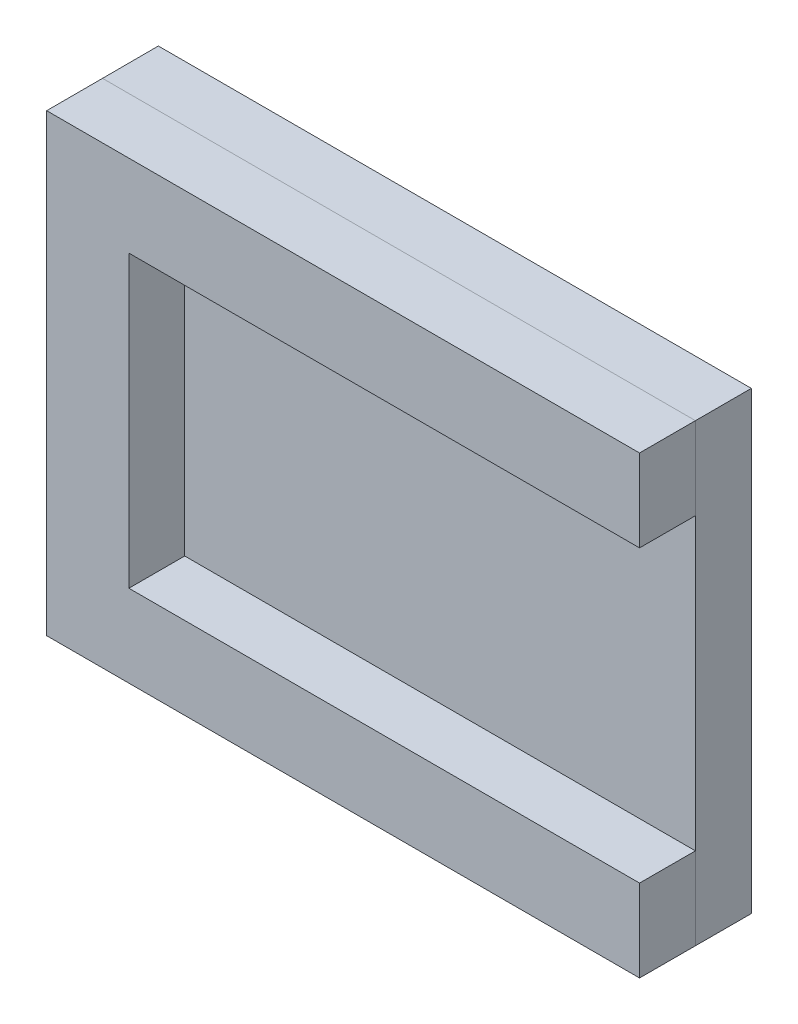
ISO-10303-21;
HEADER;
FILE_DESCRIPTION(('STEP AP214'),'2;1');
FILE_NAME('part.step','',(''),(''),'','','');
FILE_SCHEMA(('AUTOMOTIVE_DESIGN { 1 0 10303 214 1 1 1 1 }'));
ENDSEC;
DATA;
#1=APPLICATION_CONTEXT('core data for automotive mechanical design processes');
#2=APPLICATION_PROTOCOL_DEFINITION('international standard','automotive_design',2000,#1);
#3=PRODUCT_CONTEXT('',#1,'mechanical');
#4=PRODUCT('Part','Part','',(#3));
#5=PRODUCT_RELATED_PRODUCT_CATEGORY('part','',(#4));
#6=PRODUCT_DEFINITION_FORMATION('','',#4);
#7=PRODUCT_DEFINITION_CONTEXT('part definition',#1,'design');
#8=PRODUCT_DEFINITION('design','',#6,#7);
#9=PRODUCT_DEFINITION_SHAPE('','',#8);
#10=(LENGTH_UNIT() NAMED_UNIT(*) SI_UNIT(.MILLI.,.METRE.));
#11=(NAMED_UNIT(*) PLANE_ANGLE_UNIT() SI_UNIT($,.RADIAN.));
#12=(NAMED_UNIT(*) SI_UNIT($,.STERADIAN.) SOLID_ANGLE_UNIT());
#13=UNCERTAINTY_MEASURE_WITH_UNIT(LENGTH_MEASURE(1.E-05),#10,'distance_accuracy_value','');
#14=(GEOMETRIC_REPRESENTATION_CONTEXT(3) GLOBAL_UNCERTAINTY_ASSIGNED_CONTEXT((#13)) GLOBAL_UNIT_ASSIGNED_CONTEXT((#10,
#11,#12)) REPRESENTATION_CONTEXT('',''));
#15=CARTESIAN_POINT('',(0.,0.,0.));
#16=DIRECTION('',(0.,0.,1.));
#17=DIRECTION('',(1.,0.,0.));
#18=AXIS2_PLACEMENT_3D('',#15,#16,#17);
#19=CARTESIAN_POINT('',(-41.7587994731434,0.,3.));
#20=DIRECTION('',(1.,0.,0.));
#21=DIRECTION('',(0.,0.,-1.));
#22=AXIS2_PLACEMENT_3D('',#19,#20,#21);
#23=PLANE('',#22);
#24=CARTESIAN_POINT('',(-41.7527595629394,-30.6599415069898,0.));
#25=DIRECTION('',(0.,-1.,0.));
#26=VECTOR('',#25,1.);
#27=LINE('',#24,#26);
#28=CARTESIAN_POINT('',(-41.7557795180414,-30.6599415069898,0.));
#29=VERTEX_POINT('',#28);
#30=CARTESIAN_POINT('',(-41.7557795180414,-35.077278712933,0.));
#31=VERTEX_POINT('',#30);
#32=EDGE_CURVE('E157',#29,#31,#27,.T.);
#33=ORIENTED_EDGE('',*,*,#32,.F.);
#34=DIRECTION('',(0.,0.,-1.));
#35=VECTOR('',#34,1.);
#36=CARTESIAN_POINT('',(-41.7587994731434,-30.6599415069898,3.));
#37=LINE('',#36,#35);
#38=CARTESIAN_POINT('',(-41.7587994731434,-30.6599415069898,3.));
#39=VERTEX_POINT('',#38);
#40=EDGE_CURVE('E11',#39,#29,#37,.T.);
#41=ORIENTED_EDGE('',*,*,#40,.F.);
#42=DIRECTION('',(0.,-1.,0.));
#43=VECTOR('',#42,1.);
#44=CARTESIAN_POINT('',(-41.7587994731434,0.,3.));
#45=LINE('',#44,#43);
#46=CARTESIAN_POINT('',(-41.7587994731434,-35.077278712933,3.));
#47=VERTEX_POINT('',#46);
#48=EDGE_CURVE('E241',#39,#47,#45,.T.);
#49=ORIENTED_EDGE('',*,*,#48,.T.);
#50=DIRECTION('',(0.,0.,-1.));
#51=VECTOR('',#50,1.);
#52=CARTESIAN_POINT('',(-41.7587994731434,-35.077278712933,3.));
#53=LINE('',#52,#51);
#54=EDGE_CURVE('E93',#47,#31,#53,.T.);
#55=ORIENTED_EDGE('',*,*,#54,.T.);
#56=EDGE_LOOP('',(#33,#41,#49,#55));
#57=FACE_BOUND('',#56,.T.);
#58=ADVANCED_FACE('F41',(#57),#23,.T.);
#59=CARTESIAN_POINT('',(0.,-30.6599415069898,3.));
#60=DIRECTION('',(0.,1.,0.));
#61=DIRECTION('',(0.,0.,1.));
#62=AXIS2_PLACEMENT_3D('',#59,#60,#61);
#63=PLANE('',#62);
#64=DIRECTION('',(1.,0.,0.));
#65=VECTOR('',#64,1.);
#66=CARTESIAN_POINT('',(0.,-30.6599415069898,0.));
#67=LINE('',#66,#65);
#68=CARTESIAN_POINT('',(-69.1946390522348,-30.6599415069898,0.));
#69=VERTEX_POINT('',#68);
#70=EDGE_CURVE('E146',#69,#29,#67,.T.);
#71=ORIENTED_EDGE('',*,*,#70,.F.);
#72=DIRECTION('',(0.,0.,-1.));
#73=VECTOR('',#72,1.);
#74=CARTESIAN_POINT('',(-69.1946390522348,-30.6599415069898,3.));
#75=LINE('',#74,#73);
#76=CARTESIAN_POINT('',(-69.1946390522348,-30.6599415069898,3.));
#77=VERTEX_POINT('',#76);
#78=EDGE_CURVE('E52',#77,#69,#75,.T.);
#79=ORIENTED_EDGE('',*,*,#78,.F.);
#80=DIRECTION('',(1.,0.,0.));
#81=VECTOR('',#80,1.);
#82=CARTESIAN_POINT('',(0.,-30.6599415069898,3.));
#83=LINE('',#82,#81);
#84=EDGE_CURVE('E287',#77,#39,#83,.T.);
#85=ORIENTED_EDGE('',*,*,#84,.T.);
#86=ORIENTED_EDGE('',*,*,#40,.T.);
#87=EDGE_LOOP('',(#71,#79,#85,#86));
#88=FACE_BOUND('',#87,.T.);
#89=ADVANCED_FACE('F322',(#88),#63,.T.);
#90=CARTESIAN_POINT('',(-69.1946390522348,0.,3.));
#91=DIRECTION('',(1.,0.,0.));
#92=DIRECTION('',(0.,0.,-1.));
#93=AXIS2_PLACEMENT_3D('',#90,#91,#92);
#94=PLANE('',#93);
#95=DIRECTION('',(0.,-1.,0.));
#96=VECTOR('',#95,1.);
#97=CARTESIAN_POINT('',(-69.1946390522348,0.,0.));
#98=LINE('',#97,#96);
#99=CARTESIAN_POINT('',(-69.1946390522348,-15.065028643299,0.));
#100=VERTEX_POINT('',#99);
#101=EDGE_CURVE('E141',#100,#69,#98,.T.);
#102=ORIENTED_EDGE('',*,*,#101,.F.);
#103=DIRECTION('',(0.,0.,-1.));
#104=VECTOR('',#103,1.);
#105=CARTESIAN_POINT('',(-69.1946390522348,-15.065028643299,3.));
#106=LINE('',#105,#104);
#107=CARTESIAN_POINT('',(-69.1946390522348,-15.065028643299,3.));
#108=VERTEX_POINT('',#107);
#109=EDGE_CURVE('E149',#108,#100,#106,.T.);
#110=ORIENTED_EDGE('',*,*,#109,.F.);
#111=DIRECTION('',(0.,-1.,0.));
#112=VECTOR('',#111,1.);
#113=CARTESIAN_POINT('',(-69.1946390522348,0.,3.));
#114=LINE('',#113,#112);
#115=EDGE_CURVE('E291',#108,#77,#114,.T.);
#116=ORIENTED_EDGE('',*,*,#115,.T.);
#117=ORIENTED_EDGE('',*,*,#78,.T.);
#118=EDGE_LOOP('',(#102,#110,#116,#117));
#119=FACE_BOUND('',#118,.T.);
#120=ADVANCED_FACE('F326',(#119),#94,.T.);
#121=CARTESIAN_POINT('',(0.,-15.065028643299,3.));
#122=DIRECTION('',(0.,1.,0.));
#123=DIRECTION('',(0.,0.,1.));
#124=AXIS2_PLACEMENT_3D('',#121,#122,#123);
#125=PLANE('',#124);
#126=DIRECTION('',(1.,0.,0.));
#127=VECTOR('',#126,1.);
#128=CARTESIAN_POINT('',(0.,-15.065028643299,0.));
#129=LINE('',#128,#127);
#130=CARTESIAN_POINT('',(-41.7557795180414,-15.065028643299,0.));
#131=VERTEX_POINT('',#130);
#132=EDGE_CURVE('E145',#100,#131,#129,.T.);
#133=ORIENTED_EDGE('',*,*,#132,.T.);
#134=DIRECTION('',(0.,0.,-1.));
#135=VECTOR('',#134,1.);
#136=CARTESIAN_POINT('',(-41.7587994731434,-15.065028643299,3.));
#137=LINE('',#136,#135);
#138=CARTESIAN_POINT('',(-41.7587994731434,-15.065028643299,3.));
#139=VERTEX_POINT('',#138);
#140=EDGE_CURVE('E152',#139,#131,#137,.T.);
#141=ORIENTED_EDGE('',*,*,#140,.F.);
#142=DIRECTION('',(1.,0.,0.));
#143=VECTOR('',#142,1.);
#144=CARTESIAN_POINT('',(0.,-15.065028643299,3.));
#145=LINE('',#144,#143);
#146=EDGE_CURVE('E295',#108,#139,#145,.T.);
#147=ORIENTED_EDGE('',*,*,#146,.F.);
#148=ORIENTED_EDGE('',*,*,#109,.T.);
#149=EDGE_LOOP('',(#133,#141,#147,#148));
#150=FACE_BOUND('',#149,.T.);
#151=ADVANCED_FACE('F196',(#150),#125,.F.);
#152=CARTESIAN_POINT('',(-41.7587994731434,0.,3.));
#153=DIRECTION('',(-1.,0.,0.));
#154=DIRECTION('',(0.,0.,1.));
#155=AXIS2_PLACEMENT_3D('',#152,#153,#154);
#156=PLANE('',#155);
#157=CARTESIAN_POINT('',(-41.7587994731434,-15.065028643299,0.));
#158=DIRECTION('',(0.,1.,0.));
#159=VECTOR('',#158,1.);
#160=LINE('',#157,#159);
#161=CARTESIAN_POINT('',(-41.7557795180414,-10.6429825061691,0.));
#162=VERTEX_POINT('',#161);
#163=EDGE_CURVE('E212',#131,#162,#160,.T.);
#164=ORIENTED_EDGE('',*,*,#163,.T.);
#165=DIRECTION('',(0.,0.,-1.));
#166=VECTOR('',#165,1.);
#167=CARTESIAN_POINT('',(-41.7587994731434,-10.6476914373559,3.));
#168=LINE('',#167,#166);
#169=CARTESIAN_POINT('',(-41.7587994731434,-10.6476914373559,3.));
#170=VERTEX_POINT('',#169);
#171=EDGE_CURVE('E129',#170,#162,#168,.T.);
#172=ORIENTED_EDGE('',*,*,#171,.F.);
#173=DIRECTION('',(0.,1.,0.));
#174=VECTOR('',#173,1.);
#175=CARTESIAN_POINT('',(-41.7587994731434,0.,3.));
#176=LINE('',#175,#174);
#177=EDGE_CURVE('E119',#139,#170,#176,.T.);
#178=ORIENTED_EDGE('',*,*,#177,.F.);
#179=ORIENTED_EDGE('',*,*,#140,.T.);
#180=EDGE_LOOP('',(#164,#172,#178,#179));
#181=FACE_BOUND('',#180,.T.);
#182=ADVANCED_FACE('F191',(#181),#156,.F.);
#183=CARTESIAN_POINT('',(0.,-10.6476914373559,3.));
#184=DIRECTION('',(0.,-1.,0.));
#185=DIRECTION('',(0.,0.,-1.));
#186=AXIS2_PLACEMENT_3D('',#183,#184,#185);
#187=PLANE('',#186);
#188=CARTESIAN_POINT('',(-41.7587994731434,-10.6476914373559,0.));
#189=DIRECTION('',(-1.,0.,0.));
#190=VECTOR('',#189,1.);
#191=LINE('',#188,#190);
#192=CARTESIAN_POINT('',(-73.6119762581779,-10.6429825061691,0.));
#193=VERTEX_POINT('',#192);
#194=EDGE_CURVE('E85',#162,#193,#191,.T.);
#195=ORIENTED_EDGE('',*,*,#194,.T.);
#196=DIRECTION('',(0.,0.,-1.));
#197=VECTOR('',#196,1.);
#198=CARTESIAN_POINT('',(-73.6119762581779,-10.6476914373559,3.));
#199=LINE('',#198,#197);
#200=CARTESIAN_POINT('',(-73.6119762581779,-10.6476914373559,3.));
#201=VERTEX_POINT('',#200);
#202=EDGE_CURVE('E123',#201,#193,#199,.T.);
#203=ORIENTED_EDGE('',*,*,#202,.F.);
#204=DIRECTION('',(-1.,0.,0.));
#205=VECTOR('',#204,1.);
#206=CARTESIAN_POINT('',(0.,-10.6476914373559,3.));
#207=LINE('',#206,#205);
#208=EDGE_CURVE('E113',#170,#201,#207,.T.);
#209=ORIENTED_EDGE('',*,*,#208,.F.);
#210=ORIENTED_EDGE('',*,*,#171,.T.);
#211=EDGE_LOOP('',(#195,#203,#209,#210));
#212=FACE_BOUND('',#211,.T.);
#213=ADVANCED_FACE('F124',(#212),#187,.F.);
#214=CARTESIAN_POINT('',(-73.6119762581779,0.,3.));
#215=DIRECTION('',(1.,0.,0.));
#216=DIRECTION('',(0.,0.,-1.));
#217=AXIS2_PLACEMENT_3D('',#214,#215,#216);
#218=PLANE('',#217);
#219=ORIENTED_EDGE('',*,*,#202,.T.);
#220=DIRECTION('',(0.,0.,1.));
#221=VECTOR('',#220,1.);
#222=CARTESIAN_POINT('',(-73.6119762581779,-10.6382735749824,-3.));
#223=LINE('',#222,#221);
#224=CARTESIAN_POINT('',(-73.6119762581779,-10.6382735749824,-3.));
#225=VERTEX_POINT('',#224);
#226=EDGE_CURVE('E235',#225,#193,#223,.T.);
#227=ORIENTED_EDGE('',*,*,#226,.F.);
#228=DIRECTION('',(0.,1.,0.));
#229=VECTOR('',#228,1.);
#230=CARTESIAN_POINT('',(-73.6119762581779,-35.077278712933,-3.));
#231=LINE('',#230,#229);
#232=CARTESIAN_POINT('',(-73.6119762581779,-35.077278712933,-3.));
#233=VERTEX_POINT('',#232);
#234=EDGE_CURVE('E305',#233,#225,#231,.T.);
#235=ORIENTED_EDGE('',*,*,#234,.F.);
#236=DIRECTION('',(0.,0.,-1.));
#237=VECTOR('',#236,1.);
#238=CARTESIAN_POINT('',(-73.6119762581779,-35.077278712933,3.));
#239=LINE('',#238,#237);
#240=CARTESIAN_POINT('',(-73.6119762581779,-35.077278712933,3.));
#241=VERTEX_POINT('',#240);
#242=EDGE_CURVE('E130',#241,#233,#239,.T.);
#243=ORIENTED_EDGE('',*,*,#242,.F.);
#244=DIRECTION('',(0.,-1.,0.));
#245=VECTOR('',#244,1.);
#246=CARTESIAN_POINT('',(-73.6119762581779,0.,3.));
#247=LINE('',#246,#245);
#248=EDGE_CURVE('E116',#201,#241,#247,.T.);
#249=ORIENTED_EDGE('',*,*,#248,.F.);
#250=EDGE_LOOP('',(#219,#227,#235,#243,#249));
#251=FACE_BOUND('',#250,.T.);
#252=ADVANCED_FACE('F132',(#251),#218,.F.);
#253=CARTESIAN_POINT('',(0.,-35.077278712933,3.));
#254=DIRECTION('',(0.,1.,0.));
#255=DIRECTION('',(0.,0.,1.));
#256=AXIS2_PLACEMENT_3D('',#253,#254,#255);
#257=PLANE('',#256);
#258=ORIENTED_EDGE('',*,*,#242,.T.);
#259=DIRECTION('',(1.,0.,0.));
#260=VECTOR('',#259,1.);
#261=CARTESIAN_POINT('',(-73.6119762581779,-35.077278712933,-3.));
#262=LINE('',#261,#260);
#263=CARTESIAN_POINT('',(-41.7527595629394,-35.077278712933,-3.));
#264=VERTEX_POINT('',#263);
#265=EDGE_CURVE('E236',#233,#264,#262,.T.);
#266=ORIENTED_EDGE('',*,*,#265,.T.);
#267=DIRECTION('',(0.,0.,1.));
#268=VECTOR('',#267,1.);
#269=CARTESIAN_POINT('',(-41.7527595629394,-35.077278712933,-3.));
#270=LINE('',#269,#268);
#271=EDGE_CURVE('E272',#264,#31,#270,.T.);
#272=ORIENTED_EDGE('',*,*,#271,.T.);
#273=ORIENTED_EDGE('',*,*,#54,.F.);
#274=DIRECTION('',(1.,0.,0.));
#275=VECTOR('',#274,1.);
#276=CARTESIAN_POINT('',(0.,-35.077278712933,3.));
#277=LINE('',#276,#275);
#278=EDGE_CURVE('E61',#241,#47,#277,.T.);
#279=ORIENTED_EDGE('',*,*,#278,.F.);
#280=EDGE_LOOP('',(#258,#266,#272,#273,#279));
#281=FACE_BOUND('',#280,.T.);
#282=ADVANCED_FACE('F372',(#281),#257,.F.);
#283=CARTESIAN_POINT('',(0.,0.,3.));
#284=DIRECTION('',(0.,0.,1.));
#285=DIRECTION('',(1.,0.,0.));
#286=AXIS2_PLACEMENT_3D('',#283,#284,#285);
#287=PLANE('',#286);
#288=ORIENTED_EDGE('',*,*,#48,.F.);
#289=ORIENTED_EDGE('',*,*,#84,.F.);
#290=ORIENTED_EDGE('',*,*,#115,.F.);
#291=ORIENTED_EDGE('',*,*,#146,.T.);
#292=ORIENTED_EDGE('',*,*,#177,.T.);
#293=ORIENTED_EDGE('',*,*,#208,.T.);
#294=ORIENTED_EDGE('',*,*,#248,.T.);
#295=ORIENTED_EDGE('',*,*,#278,.T.);
#296=EDGE_LOOP('',(#288,#289,#290,#291,#292,#293,#294,#295));
#297=FACE_BOUND('',#296,.T.);
#298=ADVANCED_FACE('F114',(#297),#287,.T.);
#299=CARTESIAN_POINT('',(-41.7527595629394,-35.077278712933,-3.));
#300=DIRECTION('',(1.,0.,0.));
#301=DIRECTION('',(0.,0.,-1.));
#302=AXIS2_PLACEMENT_3D('',#299,#300,#301);
#303=PLANE('',#302);
#304=ORIENTED_EDGE('',*,*,#32,.T.);
#305=ORIENTED_EDGE('',*,*,#271,.F.);
#306=DIRECTION('',(0.,1.,0.));
#307=VECTOR('',#306,1.);
#308=CARTESIAN_POINT('',(-41.7527595629394,-35.077278712933,-3.));
#309=LINE('',#308,#307);
#310=CARTESIAN_POINT('',(-41.7527595629394,-10.6382735749824,-3.));
#311=VERTEX_POINT('',#310);
#312=EDGE_CURVE('E231',#264,#311,#309,.T.);
#313=ORIENTED_EDGE('',*,*,#312,.T.);
#314=DIRECTION('',(0.,0.,1.));
#315=VECTOR('',#314,1.);
#316=CARTESIAN_POINT('',(-41.7527595629394,-10.6382735749824,-3.));
#317=LINE('',#316,#315);
#318=EDGE_CURVE('E223',#311,#162,#317,.T.);
#319=ORIENTED_EDGE('',*,*,#318,.T.);
#320=ORIENTED_EDGE('',*,*,#163,.F.);
#321=CARTESIAN_POINT('',(-41.7527595629394,-30.6599415069898,0.));
#322=DIRECTION('',(0.,1.,0.));
#323=VECTOR('',#322,1.);
#324=LINE('',#321,#323);
#325=EDGE_CURVE('E283',#29,#131,#324,.T.);
#326=ORIENTED_EDGE('',*,*,#325,.F.);
#327=EDGE_LOOP('',(#304,#305,#313,#319,#320,#326));
#328=FACE_BOUND('',#327,.T.);
#329=ADVANCED_FACE('F224',(#328),#303,.T.);
#330=CARTESIAN_POINT('',(-73.6119762581779,-10.6382735749824,-3.));
#331=DIRECTION('',(0.,-1.,0.));
#332=DIRECTION('',(1.,0.,0.));
#333=AXIS2_PLACEMENT_3D('',#330,#331,#332);
#334=PLANE('',#333);
#335=ORIENTED_EDGE('',*,*,#194,.F.);
#336=ORIENTED_EDGE('',*,*,#318,.F.);
#337=DIRECTION('',(1.,0.,0.));
#338=VECTOR('',#337,1.);
#339=CARTESIAN_POINT('',(-73.6119762581779,-10.6382735749824,-3.));
#340=LINE('',#339,#338);
#341=EDGE_CURVE('E309',#225,#311,#340,.T.);
#342=ORIENTED_EDGE('',*,*,#341,.F.);
#343=ORIENTED_EDGE('',*,*,#226,.T.);
#344=EDGE_LOOP('',(#335,#336,#342,#343));
#345=FACE_BOUND('',#344,.T.);
#346=ADVANCED_FACE('F239',(#345),#334,.F.);
#347=CARTESIAN_POINT('',(0.,0.,-3.));
#348=DIRECTION('',(0.,0.,-1.));
#349=DIRECTION('',(-1.,0.,0.));
#350=AXIS2_PLACEMENT_3D('',#347,#348,#349);
#351=PLANE('',#350);
#352=ORIENTED_EDGE('',*,*,#312,.F.);
#353=ORIENTED_EDGE('',*,*,#265,.F.);
#354=ORIENTED_EDGE('',*,*,#234,.T.);
#355=ORIENTED_EDGE('',*,*,#341,.T.);
#356=EDGE_LOOP('',(#352,#353,#354,#355));
#357=FACE_BOUND('',#356,.T.);
#358=ADVANCED_FACE('F259',(#357),#351,.T.);
#359=CARTESIAN_POINT('',(0.,0.,0.));
#360=DIRECTION('',(0.,0.,-1.));
#361=DIRECTION('',(-1.,0.,0.));
#362=AXIS2_PLACEMENT_3D('',#359,#360,#361);
#363=PLANE('',#362);
#364=ORIENTED_EDGE('',*,*,#132,.F.);
#365=ORIENTED_EDGE('',*,*,#101,.T.);
#366=ORIENTED_EDGE('',*,*,#70,.T.);
#367=ORIENTED_EDGE('',*,*,#325,.T.);
#368=EDGE_LOOP('',(#364,#365,#366,#367));
#369=FACE_BOUND('',#368,.T.);
#370=ADVANCED_FACE('F260',(#369),#363,.F.);
#371=CLOSED_SHELL('',(#58,#89,#120,#151,#182,#213,#252,#282,#298,#329,#346,#358,#370));
#372=MANIFOLD_SOLID_BREP('B2',#371);
#373=ADVANCED_BREP_SHAPE_REPRESENTATION('',(#18,#372),#14);
#374=SHAPE_DEFINITION_REPRESENTATION(#9,#373);
ENDSEC;
END-ISO-10303-21;
